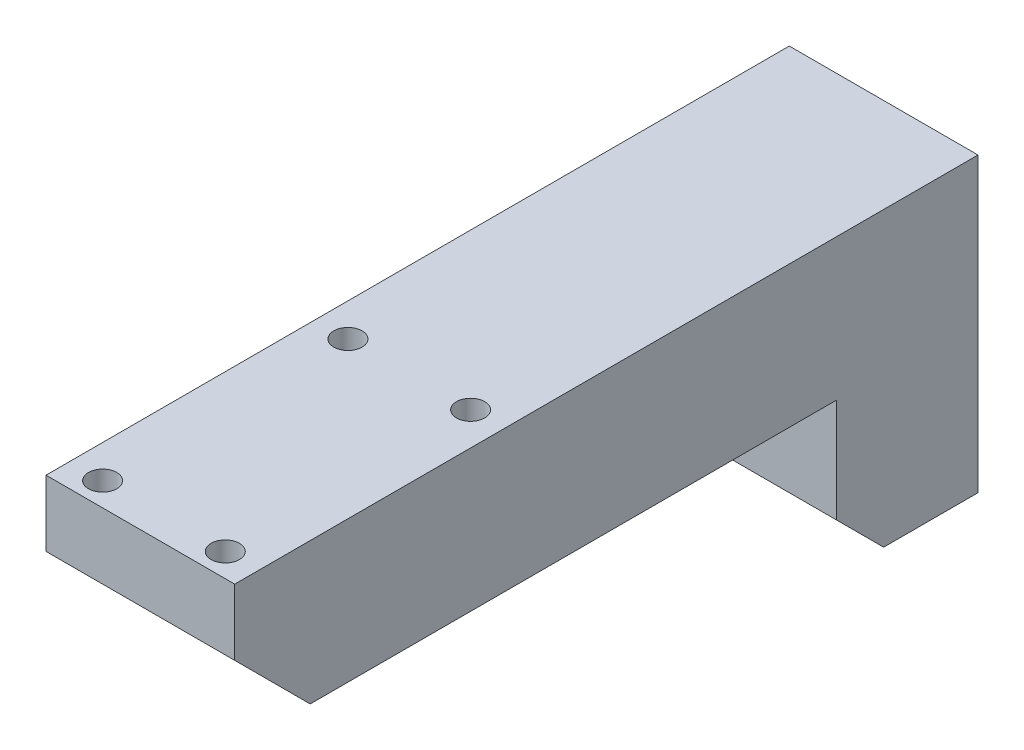
ISO-10303-21;
HEADER;
FILE_DESCRIPTION(('STEP AP214'),'2;1');
FILE_NAME('part.step','',(''),(''),'','','');
FILE_SCHEMA(('AUTOMOTIVE_DESIGN { 1 0 10303 214 1 1 1 1 }'));
ENDSEC;
DATA;
#1=APPLICATION_CONTEXT('core data for automotive mechanical design processes');
#2=APPLICATION_PROTOCOL_DEFINITION('international standard','automotive_design',2000,#1);
#3=PRODUCT_CONTEXT('',#1,'mechanical');
#4=PRODUCT('Part','Part','',(#3));
#5=PRODUCT_RELATED_PRODUCT_CATEGORY('part','',(#4));
#6=PRODUCT_DEFINITION_FORMATION('','',#4);
#7=PRODUCT_DEFINITION_CONTEXT('part definition',#1,'design');
#8=PRODUCT_DEFINITION('design','',#6,#7);
#9=PRODUCT_DEFINITION_SHAPE('','',#8);
#10=(LENGTH_UNIT() NAMED_UNIT(*) SI_UNIT(.MILLI.,.METRE.));
#11=(NAMED_UNIT(*) PLANE_ANGLE_UNIT() SI_UNIT($,.RADIAN.));
#12=(NAMED_UNIT(*) SI_UNIT($,.STERADIAN.) SOLID_ANGLE_UNIT());
#13=UNCERTAINTY_MEASURE_WITH_UNIT(LENGTH_MEASURE(1.E-05),#10,'distance_accuracy_value','');
#14=(GEOMETRIC_REPRESENTATION_CONTEXT(3) GLOBAL_UNCERTAINTY_ASSIGNED_CONTEXT((#13)) GLOBAL_UNIT_ASSIGNED_CONTEXT((#10,
#11,#12)) REPRESENTATION_CONTEXT('',''));
#15=CARTESIAN_POINT('',(0.,0.,0.));
#16=DIRECTION('',(0.,0.,1.));
#17=DIRECTION('',(1.,0.,0.));
#18=AXIS2_PLACEMENT_3D('',#15,#16,#17);
#19=CARTESIAN_POINT('',(-13.,0.,73.775));
#20=DIRECTION('',(0.,1.,0.));
#21=DIRECTION('',(0.,0.,1.));
#22=AXIS2_PLACEMENT_3D('',#19,#20,#21);
#23=CYLINDRICAL_SURFACE('',#22,3.);
#24=CARTESIAN_POINT('',(-13.,30.,73.775));
#25=DIRECTION('',(0.,1.,0.));
#26=DIRECTION('',(0.,0.,1.));
#27=AXIS2_PLACEMENT_3D('',#24,#25,#26);
#28=CIRCLE('',#27,3.);
#29=CARTESIAN_POINT('',(-13.,30.,76.775));
#30=VERTEX_POINT('',#29);
#31=EDGE_CURVE('E170',#30,#30,#28,.T.);
#32=ORIENTED_EDGE('',*,*,#31,.T.);
#33=EDGE_LOOP('',(#32));
#34=FACE_BOUND('',#33,.T.);
#35=CARTESIAN_POINT('',(-13.,15.,73.775));
#36=DIRECTION('',(0.,-1.,0.));
#37=DIRECTION('',(0.,0.,-1.));
#38=AXIS2_PLACEMENT_3D('',#35,#36,#37);
#39=CIRCLE('',#38,3.);
#40=CARTESIAN_POINT('',(-13.,15.,70.775));
#41=VERTEX_POINT('',#40);
#42=EDGE_CURVE('E159',#41,#41,#39,.F.);
#43=ORIENTED_EDGE('',*,*,#42,.F.);
#44=EDGE_LOOP('',(#43));
#45=FACE_BOUND('',#44,.T.);
#46=ADVANCED_FACE('F38',(#34,#45),#23,.F.);
#47=CARTESIAN_POINT('',(13.,0.,73.775));
#48=DIRECTION('',(0.,1.,0.));
#49=DIRECTION('',(0.,0.,1.));
#50=AXIS2_PLACEMENT_3D('',#47,#48,#49);
#51=CYLINDRICAL_SURFACE('',#50,3.);
#52=CARTESIAN_POINT('',(13.,30.,73.775));
#53=DIRECTION('',(0.,1.,0.));
#54=DIRECTION('',(0.,0.,1.));
#55=AXIS2_PLACEMENT_3D('',#52,#53,#54);
#56=CIRCLE('',#55,3.);
#57=CARTESIAN_POINT('',(13.,30.,76.775));
#58=VERTEX_POINT('',#57);
#59=EDGE_CURVE('E167',#58,#58,#56,.T.);
#60=ORIENTED_EDGE('',*,*,#59,.T.);
#61=EDGE_LOOP('',(#60));
#62=FACE_BOUND('',#61,.T.);
#63=CARTESIAN_POINT('',(13.,15.,73.775));
#64=DIRECTION('',(0.,-1.,0.));
#65=DIRECTION('',(0.,0.,-1.));
#66=AXIS2_PLACEMENT_3D('',#63,#64,#65);
#67=CIRCLE('',#66,3.);
#68=CARTESIAN_POINT('',(13.,15.,70.775));
#69=VERTEX_POINT('',#68);
#70=EDGE_CURVE('E163',#69,#69,#67,.F.);
#71=ORIENTED_EDGE('',*,*,#70,.F.);
#72=EDGE_LOOP('',(#71));
#73=FACE_BOUND('',#72,.T.);
#74=ADVANCED_FACE('F281',(#62,#73),#51,.F.);
#75=CARTESIAN_POINT('',(0.,0.,0.));
#76=DIRECTION('',(0.,1.,0.));
#77=DIRECTION('',(0.,0.,1.));
#78=AXIS2_PLACEMENT_3D('',#75,#76,#77);
#79=PLANE('',#78);
#80=CARTESIAN_POINT('',(-13.,0.,21.775));
#81=DIRECTION('',(0.,1.,0.));
#82=DIRECTION('',(0.,0.,1.));
#83=AXIS2_PLACEMENT_3D('',#80,#81,#82);
#84=CIRCLE('',#83,3.);
#85=CARTESIAN_POINT('',(-13.,0.,24.775));
#86=VERTEX_POINT('',#85);
#87=EDGE_CURVE('E177',#86,#86,#84,.T.);
#88=ORIENTED_EDGE('',*,*,#87,.T.);
#89=EDGE_LOOP('',(#88));
#90=FACE_BOUND('',#89,.T.);
#91=CARTESIAN_POINT('',(13.,0.,21.775));
#92=DIRECTION('',(0.,1.,0.));
#93=DIRECTION('',(0.,0.,1.));
#94=AXIS2_PLACEMENT_3D('',#91,#92,#93);
#95=CIRCLE('',#94,3.);
#96=CARTESIAN_POINT('',(13.,0.,24.775));
#97=VERTEX_POINT('',#96);
#98=EDGE_CURVE('E171',#97,#97,#95,.T.);
#99=ORIENTED_EDGE('',*,*,#98,.T.);
#100=EDGE_LOOP('',(#99));
#101=FACE_BOUND('',#100,.T.);
#102=DIRECTION('',(0.,0.,-1.));
#103=VECTOR('',#102,1.);
#104=CARTESIAN_POINT('',(20.,0.,78.775));
#105=LINE('',#104,#103);
#106=CARTESIAN_POINT('',(20.,0.,62.775));
#107=VERTEX_POINT('',#106);
#108=CARTESIAN_POINT('',(20.,0.,-48.775));
#109=VERTEX_POINT('',#108);
#110=EDGE_CURVE('E204',#107,#109,#105,.T.);
#111=ORIENTED_EDGE('',*,*,#110,.F.);
#112=DIRECTION('',(-1.,0.,0.));
#113=VECTOR('',#112,1.);
#114=CARTESIAN_POINT('',(0.,0.,62.775));
#115=LINE('',#114,#113);
#116=CARTESIAN_POINT('',(-20.,0.,62.775));
#117=VERTEX_POINT('',#116);
#118=EDGE_CURVE('E230',#107,#117,#115,.T.);
#119=ORIENTED_EDGE('',*,*,#118,.T.);
#120=DIRECTION('',(0.,0.,1.));
#121=VECTOR('',#120,1.);
#122=CARTESIAN_POINT('',(-20.,0.,78.775));
#123=LINE('',#122,#121);
#124=CARTESIAN_POINT('',(-20.,0.,-48.775));
#125=VERTEX_POINT('',#124);
#126=EDGE_CURVE('E199',#125,#117,#123,.T.);
#127=ORIENTED_EDGE('',*,*,#126,.F.);
#128=DIRECTION('',(-1.,0.,0.));
#129=VECTOR('',#128,1.);
#130=CARTESIAN_POINT('',(20.,0.,-48.775));
#131=LINE('',#130,#129);
#132=EDGE_CURVE('E184',#109,#125,#131,.T.);
#133=ORIENTED_EDGE('',*,*,#132,.F.);
#134=EDGE_LOOP('',(#111,#119,#127,#133));
#135=FACE_BOUND('',#134,.T.);
#136=ADVANCED_FACE('F287',(#90,#101,#135),#79,.F.);
#137=CARTESIAN_POINT('',(-20.,30.,78.775));
#138=DIRECTION('',(1.,0.,0.));
#139=DIRECTION('',(0.,0.,-1.));
#140=AXIS2_PLACEMENT_3D('',#137,#138,#139);
#141=PLANE('',#140);
#142=DIRECTION('',(0.,0.,-1.));
#143=VECTOR('',#142,1.);
#144=CARTESIAN_POINT('',(-20.,-32.,-78.775));
#145=LINE('',#144,#143);
#146=CARTESIAN_POINT('',(-20.,-32.,-58.775));
#147=VERTEX_POINT('',#146);
#148=CARTESIAN_POINT('',(-20.,-32.,-78.775));
#149=VERTEX_POINT('',#148);
#150=EDGE_CURVE('E188',#147,#149,#145,.T.);
#151=ORIENTED_EDGE('',*,*,#150,.F.);
#152=DIRECTION('',(0.,0.707106781186549,0.707106781186546));
#153=VECTOR('',#152,1.);
#154=CARTESIAN_POINT('',(-20.,-32.,-58.775));
#155=LINE('',#154,#153);
#156=CARTESIAN_POINT('',(-20.,-22.,-48.775));
#157=VERTEX_POINT('',#156);
#158=EDGE_CURVE('E60',#147,#157,#155,.T.);
#159=ORIENTED_EDGE('',*,*,#158,.T.);
#160=DIRECTION('',(0.,1.,0.));
#161=VECTOR('',#160,1.);
#162=CARTESIAN_POINT('',(-20.,-32.,-48.775));
#163=LINE('',#162,#161);
#164=EDGE_CURVE('E193',#157,#125,#163,.T.);
#165=ORIENTED_EDGE('',*,*,#164,.T.);
#166=ORIENTED_EDGE('',*,*,#126,.T.);
#167=DIRECTION('',(0.,-0.707106781186546,-0.707106781186549));
#168=VECTOR('',#167,1.);
#169=CARTESIAN_POINT('',(-20.,16.,78.775));
#170=LINE('',#169,#168);
#171=CARTESIAN_POINT('',(-20.,16.,78.775));
#172=VERTEX_POINT('',#171);
#173=EDGE_CURVE('E232',#117,#172,#170,.F.);
#174=ORIENTED_EDGE('',*,*,#173,.T.);
#175=DIRECTION('',(0.,-1.,0.));
#176=VECTOR('',#175,1.);
#177=CARTESIAN_POINT('',(-20.,30.,78.775));
#178=LINE('',#177,#176);
#179=CARTESIAN_POINT('',(-20.,30.,78.775));
#180=VERTEX_POINT('',#179);
#181=EDGE_CURVE('E222',#180,#172,#178,.T.);
#182=ORIENTED_EDGE('',*,*,#181,.F.);
#183=DIRECTION('',(0.,0.,1.));
#184=VECTOR('',#183,1.);
#185=CARTESIAN_POINT('',(-20.,30.,78.775));
#186=LINE('',#185,#184);
#187=CARTESIAN_POINT('',(-20.,30.,-78.775));
#188=VERTEX_POINT('',#187);
#189=EDGE_CURVE('E200',#188,#180,#186,.T.);
#190=ORIENTED_EDGE('',*,*,#189,.F.);
#191=DIRECTION('',(0.,-1.,0.));
#192=VECTOR('',#191,1.);
#193=CARTESIAN_POINT('',(-20.,30.,-78.775));
#194=LINE('',#193,#192);
#195=EDGE_CURVE('E210',#188,#149,#194,.T.);
#196=ORIENTED_EDGE('',*,*,#195,.T.);
#197=EDGE_LOOP('',(#151,#159,#165,#166,#174,#182,#190,#196));
#198=FACE_BOUND('',#197,.T.);
#199=ADVANCED_FACE('F255',(#198),#141,.F.);
#200=CARTESIAN_POINT('',(20.,30.,78.775));
#201=DIRECTION('',(0.,0.,-1.));
#202=DIRECTION('',(-1.,0.,0.));
#203=AXIS2_PLACEMENT_3D('',#200,#201,#202);
#204=PLANE('',#203);
#205=ORIENTED_EDGE('',*,*,#181,.T.);
#206=DIRECTION('',(1.,0.,0.));
#207=VECTOR('',#206,1.);
#208=CARTESIAN_POINT('',(20.,16.,78.775));
#209=LINE('',#208,#207);
#210=CARTESIAN_POINT('',(20.,16.,78.775));
#211=VERTEX_POINT('',#210);
#212=EDGE_CURVE('E225',#172,#211,#209,.T.);
#213=ORIENTED_EDGE('',*,*,#212,.T.);
#214=DIRECTION('',(0.,-1.,0.));
#215=VECTOR('',#214,1.);
#216=CARTESIAN_POINT('',(20.,30.,78.775));
#217=LINE('',#216,#215);
#218=CARTESIAN_POINT('',(20.,30.,78.775));
#219=VERTEX_POINT('',#218);
#220=EDGE_CURVE('E219',#219,#211,#217,.T.);
#221=ORIENTED_EDGE('',*,*,#220,.F.);
#222=DIRECTION('',(1.,0.,0.));
#223=VECTOR('',#222,1.);
#224=CARTESIAN_POINT('',(20.,30.,78.775));
#225=LINE('',#224,#223);
#226=EDGE_CURVE('E203',#180,#219,#225,.T.);
#227=ORIENTED_EDGE('',*,*,#226,.F.);
#228=EDGE_LOOP('',(#205,#213,#221,#227));
#229=FACE_BOUND('',#228,.T.);
#230=ADVANCED_FACE('F313',(#229),#204,.F.);
#231=CARTESIAN_POINT('',(20.,30.,78.775));
#232=DIRECTION('',(-1.,0.,0.));
#233=DIRECTION('',(0.,0.,1.));
#234=AXIS2_PLACEMENT_3D('',#231,#232,#233);
#235=PLANE('',#234);
#236=DIRECTION('',(0.,1.,0.));
#237=VECTOR('',#236,1.);
#238=CARTESIAN_POINT('',(20.,-32.,-48.775));
#239=LINE('',#238,#237);
#240=CARTESIAN_POINT('',(20.,-22.,-48.775));
#241=VERTEX_POINT('',#240);
#242=EDGE_CURVE('E197',#241,#109,#239,.T.);
#243=ORIENTED_EDGE('',*,*,#242,.F.);
#244=DIRECTION('',(0.,-0.707106781186549,-0.707106781186546));
#245=VECTOR('',#244,1.);
#246=CARTESIAN_POINT('',(20.,-32.,-58.775));
#247=LINE('',#246,#245);
#248=CARTESIAN_POINT('',(20.,-32.,-58.775));
#249=VERTEX_POINT('',#248);
#250=EDGE_CURVE('E11',#241,#249,#247,.T.);
#251=ORIENTED_EDGE('',*,*,#250,.T.);
#252=DIRECTION('',(0.,0.,1.));
#253=VECTOR('',#252,1.);
#254=CARTESIAN_POINT('',(20.,-32.,-78.775));
#255=LINE('',#254,#253);
#256=CARTESIAN_POINT('',(20.,-32.,-78.775));
#257=VERTEX_POINT('',#256);
#258=EDGE_CURVE('E185',#257,#249,#255,.T.);
#259=ORIENTED_EDGE('',*,*,#258,.F.);
#260=DIRECTION('',(0.,-1.,0.));
#261=VECTOR('',#260,1.);
#262=CARTESIAN_POINT('',(20.,30.,-78.775));
#263=LINE('',#262,#261);
#264=CARTESIAN_POINT('',(20.,30.,-78.775));
#265=VERTEX_POINT('',#264);
#266=EDGE_CURVE('E217',#265,#257,#263,.T.);
#267=ORIENTED_EDGE('',*,*,#266,.F.);
#268=DIRECTION('',(0.,0.,-1.));
#269=VECTOR('',#268,1.);
#270=CARTESIAN_POINT('',(20.,30.,78.775));
#271=LINE('',#270,#269);
#272=EDGE_CURVE('E206',#219,#265,#271,.T.);
#273=ORIENTED_EDGE('',*,*,#272,.F.);
#274=ORIENTED_EDGE('',*,*,#220,.T.);
#275=DIRECTION('',(0.,0.707106781186546,0.707106781186549));
#276=VECTOR('',#275,1.);
#277=CARTESIAN_POINT('',(20.,16.,78.775));
#278=LINE('',#277,#276);
#279=EDGE_CURVE('E228',#211,#107,#278,.F.);
#280=ORIENTED_EDGE('',*,*,#279,.T.);
#281=ORIENTED_EDGE('',*,*,#110,.T.);
#282=EDGE_LOOP('',(#243,#251,#259,#267,#273,#274,#280,#281));
#283=FACE_BOUND('',#282,.T.);
#284=ADVANCED_FACE('F265',(#283),#235,.F.);
#285=CARTESIAN_POINT('',(20.,30.,-78.775));
#286=DIRECTION('',(0.,0.,1.));
#287=DIRECTION('',(1.,0.,0.));
#288=AXIS2_PLACEMENT_3D('',#285,#286,#287);
#289=PLANE('',#288);
#290=CARTESIAN_POINT('',(13.,-25.,-78.775));
#291=DIRECTION('',(0.,0.,-1.));
#292=DIRECTION('',(-1.,0.,0.));
#293=AXIS2_PLACEMENT_3D('',#290,#291,#292);
#294=CIRCLE('',#293,3.5);
#295=CARTESIAN_POINT('',(9.49999999999999,-25.,-78.775));
#296=VERTEX_POINT('',#295);
#297=EDGE_CURVE('E134',#296,#296,#294,.T.);
#298=ORIENTED_EDGE('',*,*,#297,.F.);
#299=EDGE_LOOP('',(#298));
#300=FACE_BOUND('',#299,.T.);
#301=CARTESIAN_POINT('',(13.,23.,-78.775));
#302=DIRECTION('',(0.,0.,-1.));
#303=DIRECTION('',(-1.,0.,0.));
#304=AXIS2_PLACEMENT_3D('',#301,#302,#303);
#305=CIRCLE('',#304,3.5);
#306=CARTESIAN_POINT('',(9.49999999999999,23.,-78.775));
#307=VERTEX_POINT('',#306);
#308=EDGE_CURVE('E133',#307,#307,#305,.T.);
#309=ORIENTED_EDGE('',*,*,#308,.F.);
#310=EDGE_LOOP('',(#309));
#311=FACE_BOUND('',#310,.T.);
#312=CARTESIAN_POINT('',(-13.,23.,-78.775));
#313=DIRECTION('',(0.,0.,-1.));
#314=DIRECTION('',(-1.,0.,0.));
#315=AXIS2_PLACEMENT_3D('',#312,#313,#314);
#316=CIRCLE('',#315,3.5);
#317=CARTESIAN_POINT('',(-16.5,23.,-78.775));
#318=VERTEX_POINT('',#317);
#319=EDGE_CURVE('E144',#318,#318,#316,.T.);
#320=ORIENTED_EDGE('',*,*,#319,.F.);
#321=EDGE_LOOP('',(#320));
#322=FACE_BOUND('',#321,.T.);
#323=CARTESIAN_POINT('',(-13.,-25.,-78.775));
#324=DIRECTION('',(0.,0.,-1.));
#325=DIRECTION('',(-1.,0.,0.));
#326=AXIS2_PLACEMENT_3D('',#323,#324,#325);
#327=CIRCLE('',#326,3.5);
#328=CARTESIAN_POINT('',(-16.5,-25.,-78.775));
#329=VERTEX_POINT('',#328);
#330=EDGE_CURVE('E150',#329,#329,#327,.T.);
#331=ORIENTED_EDGE('',*,*,#330,.F.);
#332=EDGE_LOOP('',(#331));
#333=FACE_BOUND('',#332,.T.);
#334=ORIENTED_EDGE('',*,*,#266,.T.);
#335=DIRECTION('',(1.,0.,0.));
#336=VECTOR('',#335,1.);
#337=CARTESIAN_POINT('',(20.,-32.,-78.775));
#338=LINE('',#337,#336);
#339=EDGE_CURVE('E190',#149,#257,#338,.T.);
#340=ORIENTED_EDGE('',*,*,#339,.F.);
#341=ORIENTED_EDGE('',*,*,#195,.F.);
#342=DIRECTION('',(-1.,0.,0.));
#343=VECTOR('',#342,1.);
#344=CARTESIAN_POINT('',(20.,30.,-78.775));
#345=LINE('',#344,#343);
#346=EDGE_CURVE('E208',#265,#188,#345,.T.);
#347=ORIENTED_EDGE('',*,*,#346,.F.);
#348=EDGE_LOOP('',(#334,#340,#341,#347));
#349=FACE_BOUND('',#348,.T.);
#350=ADVANCED_FACE('F262',(#300,#311,#322,#333,#349),#289,.F.);
#351=CARTESIAN_POINT('',(0.,30.,0.));
#352=DIRECTION('',(0.,1.,0.));
#353=DIRECTION('',(0.,0.,1.));
#354=AXIS2_PLACEMENT_3D('',#351,#352,#353);
#355=PLANE('',#354);
#356=CARTESIAN_POINT('',(-13.,30.,21.775));
#357=DIRECTION('',(0.,1.,0.));
#358=DIRECTION('',(0.,0.,1.));
#359=AXIS2_PLACEMENT_3D('',#356,#357,#358);
#360=CIRCLE('',#359,3.);
#361=CARTESIAN_POINT('',(-13.,30.,24.775));
#362=VERTEX_POINT('',#361);
#363=EDGE_CURVE('E166',#362,#362,#360,.T.);
#364=ORIENTED_EDGE('',*,*,#363,.F.);
#365=EDGE_LOOP('',(#364));
#366=FACE_BOUND('',#365,.T.);
#367=CARTESIAN_POINT('',(13.,30.,21.775));
#368=DIRECTION('',(0.,1.,0.));
#369=DIRECTION('',(0.,0.,1.));
#370=AXIS2_PLACEMENT_3D('',#367,#368,#369);
#371=CIRCLE('',#370,3.);
#372=CARTESIAN_POINT('',(13.,30.,24.775));
#373=VERTEX_POINT('',#372);
#374=EDGE_CURVE('E174',#373,#373,#371,.T.);
#375=ORIENTED_EDGE('',*,*,#374,.F.);
#376=EDGE_LOOP('',(#375));
#377=FACE_BOUND('',#376,.T.);
#378=ORIENTED_EDGE('',*,*,#59,.F.);
#379=EDGE_LOOP('',(#378));
#380=FACE_BOUND('',#379,.T.);
#381=ORIENTED_EDGE('',*,*,#31,.F.);
#382=EDGE_LOOP('',(#381));
#383=FACE_BOUND('',#382,.T.);
#384=ORIENTED_EDGE('',*,*,#189,.T.);
#385=ORIENTED_EDGE('',*,*,#226,.T.);
#386=ORIENTED_EDGE('',*,*,#272,.T.);
#387=ORIENTED_EDGE('',*,*,#346,.T.);
#388=EDGE_LOOP('',(#384,#385,#386,#387));
#389=FACE_BOUND('',#388,.T.);
#390=ADVANCED_FACE('F301',(#366,#377,#380,#383,#389),#355,.T.);
#391=CARTESIAN_POINT('',(20.,-32.,-48.775));
#392=DIRECTION('',(0.,0.,-1.));
#393=DIRECTION('',(-1.,0.,0.));
#394=AXIS2_PLACEMENT_3D('',#391,#392,#393);
#395=PLANE('',#394);
#396=ORIENTED_EDGE('',*,*,#164,.F.);
#397=DIRECTION('',(1.,0.,0.));
#398=VECTOR('',#397,1.);
#399=CARTESIAN_POINT('',(20.,-22.,-48.775));
#400=LINE('',#399,#398);
#401=EDGE_CURVE('E46',#157,#241,#400,.T.);
#402=ORIENTED_EDGE('',*,*,#401,.T.);
#403=ORIENTED_EDGE('',*,*,#242,.T.);
#404=ORIENTED_EDGE('',*,*,#132,.T.);
#405=EDGE_LOOP('',(#396,#402,#403,#404));
#406=FACE_BOUND('',#405,.T.);
#407=ADVANCED_FACE('F298',(#406),#395,.F.);
#408=CARTESIAN_POINT('',(0.,-32.,0.));
#409=DIRECTION('',(0.,-1.,0.));
#410=DIRECTION('',(0.,0.,-1.));
#411=AXIS2_PLACEMENT_3D('',#408,#409,#410);
#412=PLANE('',#411);
#413=ORIENTED_EDGE('',*,*,#258,.T.);
#414=DIRECTION('',(-1.,0.,0.));
#415=VECTOR('',#414,1.);
#416=CARTESIAN_POINT('',(-20.,-32.,-58.775));
#417=LINE('',#416,#415);
#418=EDGE_CURVE('E246',#249,#147,#417,.T.);
#419=ORIENTED_EDGE('',*,*,#418,.T.);
#420=ORIENTED_EDGE('',*,*,#150,.T.);
#421=ORIENTED_EDGE('',*,*,#339,.T.);
#422=EDGE_LOOP('',(#413,#419,#420,#421));
#423=FACE_BOUND('',#422,.T.);
#424=ADVANCED_FACE('F251',(#423),#412,.T.);
#425=CARTESIAN_POINT('',(13.,0.,21.775));
#426=DIRECTION('',(0.,1.,0.));
#427=DIRECTION('',(0.,0.,1.));
#428=AXIS2_PLACEMENT_3D('',#425,#426,#427);
#429=CYLINDRICAL_SURFACE('',#428,3.);
#430=ORIENTED_EDGE('',*,*,#98,.F.);
#431=EDGE_LOOP('',(#430));
#432=FACE_BOUND('',#431,.T.);
#433=ORIENTED_EDGE('',*,*,#374,.T.);
#434=EDGE_LOOP('',(#433));
#435=FACE_BOUND('',#434,.T.);
#436=ADVANCED_FACE('F297',(#432,#435),#429,.F.);
#437=CARTESIAN_POINT('',(-13.,0.,21.775));
#438=DIRECTION('',(0.,1.,0.));
#439=DIRECTION('',(0.,0.,1.));
#440=AXIS2_PLACEMENT_3D('',#437,#438,#439);
#441=CYLINDRICAL_SURFACE('',#440,3.);
#442=ORIENTED_EDGE('',*,*,#87,.F.);
#443=EDGE_LOOP('',(#442));
#444=FACE_BOUND('',#443,.T.);
#445=ORIENTED_EDGE('',*,*,#363,.T.);
#446=EDGE_LOOP('',(#445));
#447=FACE_BOUND('',#446,.T.);
#448=ADVANCED_FACE('F293',(#444,#447),#441,.F.);
#449=CARTESIAN_POINT('',(20.,16.,78.775));
#450=DIRECTION('',(0.,0.707106781186549,-0.707106781186546));
#451=DIRECTION('',(1.,0.,0.));
#452=AXIS2_PLACEMENT_3D('',#449,#450,#451);
#453=PLANE('',#452);
#454=CARTESIAN_POINT('',(13.,11.,73.775));
#455=DIRECTION('',(0.,0.707106781186549,-0.707106781186546));
#456=DIRECTION('',(0.,-0.707106781186546,-0.707106781186549));
#457=AXIS2_PLACEMENT_3D('',#454,#455,#456);
#458=ELLIPSE('',#457,7.77817459305201,5.5);
#459=CARTESIAN_POINT('',(9.22508278236463,15.,77.775));
#460=VERTEX_POINT('',#459);
#461=CARTESIAN_POINT('',(16.7749172176354,15.,77.775));
#462=VERTEX_POINT('',#461);
#463=EDGE_CURVE('E243',#460,#462,#458,.F.);
#464=ORIENTED_EDGE('',*,*,#463,.F.);
#465=DIRECTION('',(-1.,0.,0.));
#466=VECTOR('',#465,1.);
#467=CARTESIAN_POINT('',(20.,15.,77.775));
#468=LINE('',#467,#466);
#469=EDGE_CURVE('E240',#460,#462,#468,.F.);
#470=ORIENTED_EDGE('',*,*,#469,.T.);
#471=EDGE_LOOP('',(#464,#470));
#472=FACE_BOUND('',#471,.T.);
#473=CARTESIAN_POINT('',(-13.,11.,73.775));
#474=DIRECTION('',(0.,0.707106781186549,-0.707106781186546));
#475=DIRECTION('',(0.,-0.707106781186546,-0.707106781186549));
#476=AXIS2_PLACEMENT_3D('',#473,#474,#475);
#477=ELLIPSE('',#476,7.77817459305201,5.5);
#478=CARTESIAN_POINT('',(-16.7749172176354,15.,77.775));
#479=VERTEX_POINT('',#478);
#480=CARTESIAN_POINT('',(-9.22508278236463,15.,77.775));
#481=VERTEX_POINT('',#480);
#482=EDGE_CURVE('E237',#479,#481,#477,.F.);
#483=ORIENTED_EDGE('',*,*,#482,.F.);
#484=DIRECTION('',(-1.,0.,0.));
#485=VECTOR('',#484,1.);
#486=CARTESIAN_POINT('',(20.,15.,77.775));
#487=LINE('',#486,#485);
#488=EDGE_CURVE('E234',#479,#481,#487,.F.);
#489=ORIENTED_EDGE('',*,*,#488,.T.);
#490=EDGE_LOOP('',(#483,#489));
#491=FACE_BOUND('',#490,.T.);
#492=ORIENTED_EDGE('',*,*,#173,.F.);
#493=ORIENTED_EDGE('',*,*,#118,.F.);
#494=ORIENTED_EDGE('',*,*,#279,.F.);
#495=ORIENTED_EDGE('',*,*,#212,.F.);
#496=EDGE_LOOP('',(#492,#493,#494,#495));
#497=FACE_BOUND('',#496,.T.);
#498=ADVANCED_FACE('F318',(#472,#491,#497),#453,.F.);
#499=CARTESIAN_POINT('',(-13.,15.,73.775));
#500=DIRECTION('',(0.,-1.,0.));
#501=DIRECTION('',(0.,0.,-1.));
#502=AXIS2_PLACEMENT_3D('',#499,#500,#501);
#503=PLANE('',#502);
#504=CARTESIAN_POINT('',(-13.,15.,73.775));
#505=DIRECTION('',(0.,-1.,0.));
#506=DIRECTION('',(0.,0.,-1.));
#507=AXIS2_PLACEMENT_3D('',#504,#505,#506);
#508=CIRCLE('',#507,5.5);
#509=EDGE_CURVE('E156',#479,#481,#508,.T.);
#510=ORIENTED_EDGE('',*,*,#509,.T.);
#511=ORIENTED_EDGE('',*,*,#488,.F.);
#512=EDGE_LOOP('',(#510,#511));
#513=FACE_BOUND('',#512,.T.);
#514=ORIENTED_EDGE('',*,*,#42,.T.);
#515=EDGE_LOOP('',(#514));
#516=FACE_BOUND('',#515,.T.);
#517=ADVANCED_FACE('F320',(#513,#516),#503,.T.);
#518=CARTESIAN_POINT('',(-13.,15.,73.775));
#519=DIRECTION('',(0.,-1.,0.));
#520=DIRECTION('',(0.,0.,-1.));
#521=AXIS2_PLACEMENT_3D('',#518,#519,#520);
#522=CYLINDRICAL_SURFACE('',#521,5.5);
#523=ORIENTED_EDGE('',*,*,#482,.T.);
#524=ORIENTED_EDGE('',*,*,#509,.F.);
#525=EDGE_LOOP('',(#523,#524));
#526=FACE_BOUND('',#525,.T.);
#527=ADVANCED_FACE('F326',(#526),#522,.F.);
#528=CARTESIAN_POINT('',(13.,15.,73.775));
#529=DIRECTION('',(0.,-1.,0.));
#530=DIRECTION('',(0.,0.,-1.));
#531=AXIS2_PLACEMENT_3D('',#528,#529,#530);
#532=PLANE('',#531);
#533=CARTESIAN_POINT('',(13.,15.,73.775));
#534=DIRECTION('',(0.,-1.,0.));
#535=DIRECTION('',(0.,0.,-1.));
#536=AXIS2_PLACEMENT_3D('',#533,#534,#535);
#537=CIRCLE('',#536,5.5);
#538=EDGE_CURVE('E157',#460,#462,#537,.T.);
#539=ORIENTED_EDGE('',*,*,#538,.T.);
#540=ORIENTED_EDGE('',*,*,#469,.F.);
#541=EDGE_LOOP('',(#539,#540));
#542=FACE_BOUND('',#541,.T.);
#543=ORIENTED_EDGE('',*,*,#70,.T.);
#544=EDGE_LOOP('',(#543));
#545=FACE_BOUND('',#544,.T.);
#546=ADVANCED_FACE('F277',(#542,#545),#532,.T.);
#547=CARTESIAN_POINT('',(13.,15.,73.775));
#548=DIRECTION('',(0.,-1.,0.));
#549=DIRECTION('',(0.,0.,-1.));
#550=AXIS2_PLACEMENT_3D('',#547,#548,#549);
#551=CYLINDRICAL_SURFACE('',#550,5.5);
#552=ORIENTED_EDGE('',*,*,#463,.T.);
#553=ORIENTED_EDGE('',*,*,#538,.F.);
#554=EDGE_LOOP('',(#552,#553));
#555=FACE_BOUND('',#554,.T.);
#556=ADVANCED_FACE('F269',(#555),#551,.F.);
#557=CARTESIAN_POINT('',(0.,-32.,-58.775));
#558=DIRECTION('',(0.,-0.707106781186546,0.707106781186549));
#559=DIRECTION('',(1.,0.,0.));
#560=AXIS2_PLACEMENT_3D('',#557,#558,#559);
#561=PLANE('',#560);
#562=ORIENTED_EDGE('',*,*,#250,.F.);
#563=ORIENTED_EDGE('',*,*,#401,.F.);
#564=ORIENTED_EDGE('',*,*,#158,.F.);
#565=ORIENTED_EDGE('',*,*,#418,.F.);
#566=EDGE_LOOP('',(#562,#563,#564,#565));
#567=FACE_BOUND('',#566,.T.);
#568=ADVANCED_FACE('F40',(#567),#561,.T.);
#569=CARTESIAN_POINT('',(-13.,-25.,-57.775));
#570=DIRECTION('',(0.,0.,-1.));
#571=DIRECTION('',(-1.,0.,0.));
#572=AXIS2_PLACEMENT_3D('',#569,#570,#571);
#573=CONICAL_SURFACE('',#572,3.5,1.02974425867665);
#574=CARTESIAN_POINT('',(-13.,-25.,-55.6719878334035));
#575=VERTEX_POINT('',#574);
#576=VERTEX_LOOP('',#575);
#577=FACE_BOUND('',#576,.T.);
#578=CARTESIAN_POINT('',(-13.,-25.,-57.775));
#579=DIRECTION('',(0.,0.,-1.));
#580=DIRECTION('',(-1.,0.,0.));
#581=AXIS2_PLACEMENT_3D('',#578,#579,#580);
#582=CIRCLE('',#581,3.5);
#583=CARTESIAN_POINT('',(-16.5,-25.,-57.775));
#584=VERTEX_POINT('',#583);
#585=EDGE_CURVE('E153',#584,#584,#582,.T.);
#586=ORIENTED_EDGE('',*,*,#585,.T.);
#587=EDGE_LOOP('',(#586));
#588=FACE_BOUND('',#587,.T.);
#589=ADVANCED_FACE('F268',(#577,#588),#573,.F.);
#590=CARTESIAN_POINT('',(-13.,-25.,-78.775));
#591=DIRECTION('',(0.,0.,-1.));
#592=DIRECTION('',(-1.,0.,0.));
#593=AXIS2_PLACEMENT_3D('',#590,#591,#592);
#594=CYLINDRICAL_SURFACE('',#593,3.5);
#595=ORIENTED_EDGE('',*,*,#585,.F.);
#596=EDGE_LOOP('',(#595));
#597=FACE_BOUND('',#596,.T.);
#598=ORIENTED_EDGE('',*,*,#330,.T.);
#599=EDGE_LOOP('',(#598));
#600=FACE_BOUND('',#599,.T.);
#601=ADVANCED_FACE('F274',(#597,#600),#594,.F.);
#602=CARTESIAN_POINT('',(-13.,23.,-57.775));
#603=DIRECTION('',(0.,0.,-1.));
#604=DIRECTION('',(-1.,0.,0.));
#605=AXIS2_PLACEMENT_3D('',#602,#603,#604);
#606=CONICAL_SURFACE('',#605,3.5,1.02974425867665);
#607=CARTESIAN_POINT('',(-13.,23.,-55.6719878334035));
#608=VERTEX_POINT('',#607);
#609=VERTEX_LOOP('',#608);
#610=FACE_BOUND('',#609,.T.);
#611=CARTESIAN_POINT('',(-13.,23.,-57.775));
#612=DIRECTION('',(0.,0.,-1.));
#613=DIRECTION('',(-1.,0.,0.));
#614=AXIS2_PLACEMENT_3D('',#611,#612,#613);
#615=CIRCLE('',#614,3.5);
#616=CARTESIAN_POINT('',(-16.5,23.,-57.775));
#617=VERTEX_POINT('',#616);
#618=EDGE_CURVE('E147',#617,#617,#615,.T.);
#619=ORIENTED_EDGE('',*,*,#618,.T.);
#620=EDGE_LOOP('',(#619));
#621=FACE_BOUND('',#620,.T.);
#622=ADVANCED_FACE('F474',(#610,#621),#606,.F.);
#623=CARTESIAN_POINT('',(-13.,23.,-78.775));
#624=DIRECTION('',(0.,0.,-1.));
#625=DIRECTION('',(-1.,0.,0.));
#626=AXIS2_PLACEMENT_3D('',#623,#624,#625);
#627=CYLINDRICAL_SURFACE('',#626,3.5);
#628=ORIENTED_EDGE('',*,*,#618,.F.);
#629=EDGE_LOOP('',(#628));
#630=FACE_BOUND('',#629,.T.);
#631=ORIENTED_EDGE('',*,*,#319,.T.);
#632=EDGE_LOOP('',(#631));
#633=FACE_BOUND('',#632,.T.);
#634=ADVANCED_FACE('F486',(#630,#633),#627,.F.);
#635=CARTESIAN_POINT('',(13.,23.,-57.775));
#636=DIRECTION('',(0.,0.,-1.));
#637=DIRECTION('',(-1.,0.,0.));
#638=AXIS2_PLACEMENT_3D('',#635,#636,#637);
#639=CONICAL_SURFACE('',#638,3.5,1.02974425867665);
#640=CARTESIAN_POINT('',(13.,23.,-55.6719878334035));
#641=VERTEX_POINT('',#640);
#642=VERTEX_LOOP('',#641);
#643=FACE_BOUND('',#642,.T.);
#644=CARTESIAN_POINT('',(13.,23.,-57.775));
#645=DIRECTION('',(0.,0.,-1.));
#646=DIRECTION('',(-1.,0.,0.));
#647=AXIS2_PLACEMENT_3D('',#644,#645,#646);
#648=CIRCLE('',#647,3.5);
#649=CARTESIAN_POINT('',(9.5,23.,-57.775));
#650=VERTEX_POINT('',#649);
#651=EDGE_CURVE('E137',#650,#650,#648,.T.);
#652=ORIENTED_EDGE('',*,*,#651,.T.);
#653=EDGE_LOOP('',(#652));
#654=FACE_BOUND('',#653,.T.);
#655=ADVANCED_FACE('F496',(#643,#654),#639,.F.);
#656=CARTESIAN_POINT('',(13.,23.,-78.775));
#657=DIRECTION('',(0.,0.,-1.));
#658=DIRECTION('',(-1.,0.,0.));
#659=AXIS2_PLACEMENT_3D('',#656,#657,#658);
#660=CYLINDRICAL_SURFACE('',#659,3.5);
#661=ORIENTED_EDGE('',*,*,#651,.F.);
#662=EDGE_LOOP('',(#661));
#663=FACE_BOUND('',#662,.T.);
#664=ORIENTED_EDGE('',*,*,#308,.T.);
#665=EDGE_LOOP('',(#664));
#666=FACE_BOUND('',#665,.T.);
#667=ADVANCED_FACE('F127',(#663,#666),#660,.F.);
#668=CARTESIAN_POINT('',(13.,-25.,-57.775));
#669=DIRECTION('',(0.,0.,-1.));
#670=DIRECTION('',(-1.,0.,0.));
#671=AXIS2_PLACEMENT_3D('',#668,#669,#670);
#672=CONICAL_SURFACE('',#671,3.5,1.02974425867665);
#673=CARTESIAN_POINT('',(13.,-25.,-55.6719878334035));
#674=VERTEX_POINT('',#673);
#675=VERTEX_LOOP('',#674);
#676=FACE_BOUND('',#675,.T.);
#677=CARTESIAN_POINT('',(13.,-25.,-57.775));
#678=DIRECTION('',(0.,0.,-1.));
#679=DIRECTION('',(-1.,0.,0.));
#680=AXIS2_PLACEMENT_3D('',#677,#678,#679);
#681=CIRCLE('',#680,3.5);
#682=CARTESIAN_POINT('',(9.5,-25.,-57.775));
#683=VERTEX_POINT('',#682);
#684=EDGE_CURVE('E131',#683,#683,#681,.T.);
#685=ORIENTED_EDGE('',*,*,#684,.T.);
#686=EDGE_LOOP('',(#685));
#687=FACE_BOUND('',#686,.T.);
#688=ADVANCED_FACE('F123',(#676,#687),#672,.F.);
#689=CARTESIAN_POINT('',(13.,-25.,-78.775));
#690=DIRECTION('',(0.,0.,-1.));
#691=DIRECTION('',(-1.,0.,0.));
#692=AXIS2_PLACEMENT_3D('',#689,#690,#691);
#693=CYLINDRICAL_SURFACE('',#692,3.5);
#694=ORIENTED_EDGE('',*,*,#684,.F.);
#695=EDGE_LOOP('',(#694));
#696=FACE_BOUND('',#695,.T.);
#697=ORIENTED_EDGE('',*,*,#297,.T.);
#698=EDGE_LOOP('',(#697));
#699=FACE_BOUND('',#698,.T.);
#700=ADVANCED_FACE('F126',(#696,#699),#693,.F.);
#701=CLOSED_SHELL('',(#46,#74,#136,#199,#230,#284,#350,#390,#407,#424,#436,#448,#498,#517,#527,
#546,#556,#568,#589,#601,#622,#634,#655,#667,#688,#700));
#702=MANIFOLD_SOLID_BREP('B2',#701);
#703=ADVANCED_BREP_SHAPE_REPRESENTATION('',(#18,#702),#14);
#704=SHAPE_DEFINITION_REPRESENTATION(#9,#703);
ENDSEC;
END-ISO-10303-21;
